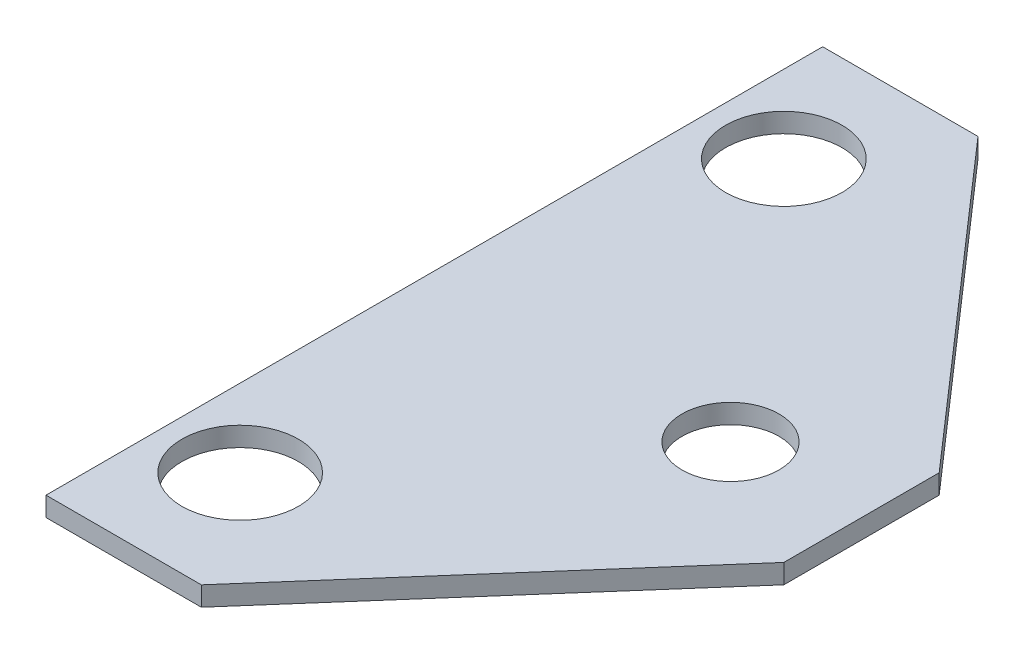
ISO-10303-21;
HEADER;
FILE_DESCRIPTION(('STEP AP214'),'2;1');
FILE_NAME('part.step','',(''),(''),'','','');
FILE_SCHEMA(('AUTOMOTIVE_DESIGN { 1 0 10303 214 1 1 1 1 }'));
ENDSEC;
DATA;
#1=APPLICATION_CONTEXT('core data for automotive mechanical design processes');
#2=APPLICATION_PROTOCOL_DEFINITION('international standard','automotive_design',2000,#1);
#3=PRODUCT_CONTEXT('',#1,'mechanical');
#4=PRODUCT('Part','Part','',(#3));
#5=PRODUCT_RELATED_PRODUCT_CATEGORY('part','',(#4));
#6=PRODUCT_DEFINITION_FORMATION('','',#4);
#7=PRODUCT_DEFINITION_CONTEXT('part definition',#1,'design');
#8=PRODUCT_DEFINITION('design','',#6,#7);
#9=PRODUCT_DEFINITION_SHAPE('','',#8);
#10=(LENGTH_UNIT() NAMED_UNIT(*) SI_UNIT(.MILLI.,.METRE.));
#11=(NAMED_UNIT(*) PLANE_ANGLE_UNIT() SI_UNIT($,.RADIAN.));
#12=(NAMED_UNIT(*) SI_UNIT($,.STERADIAN.) SOLID_ANGLE_UNIT());
#13=UNCERTAINTY_MEASURE_WITH_UNIT(LENGTH_MEASURE(1.E-05),#10,'distance_accuracy_value','');
#14=(GEOMETRIC_REPRESENTATION_CONTEXT(3) GLOBAL_UNCERTAINTY_ASSIGNED_CONTEXT((#13)) GLOBAL_UNIT_ASSIGNED_CONTEXT((#10,
#11,#12)) REPRESENTATION_CONTEXT('',''));
#15=CARTESIAN_POINT('',(0.,0.,0.));
#16=DIRECTION('',(0.,0.,1.));
#17=DIRECTION('',(1.,0.,0.));
#18=AXIS2_PLACEMENT_3D('',#15,#16,#17);
#19=CARTESIAN_POINT('',(3.40839309029562,0.5,-16.5330736697323));
#20=DIRECTION('',(0.,0.,1.));
#21=DIRECTION('',(1.,0.,0.));
#22=AXIS2_PLACEMENT_3D('',#19,#20,#21);
#23=PLANE('',#22);
#24=DIRECTION('',(-1.,0.,0.));
#25=VECTOR('',#24,1.);
#26=CARTESIAN_POINT('',(3.40839309029562,0.,-16.5330736697323));
#27=LINE('',#26,#25);
#28=CARTESIAN_POINT('',(3.40839309029562,0.,-16.5330736697323));
#29=VERTEX_POINT('',#28);
#30=CARTESIAN_POINT('',(-0.591606909704378,0.,-16.5330736697323));
#31=VERTEX_POINT('',#30);
#32=EDGE_CURVE('E121',#29,#31,#27,.T.);
#33=ORIENTED_EDGE('',*,*,#32,.T.);
#34=DIRECTION('',(0.,-1.,0.));
#35=VECTOR('',#34,1.);
#36=CARTESIAN_POINT('',(-0.591606909704378,0.5,-16.5330736697323));
#37=LINE('',#36,#35);
#38=CARTESIAN_POINT('',(-0.591606909704378,0.5,-16.5330736697323));
#39=VERTEX_POINT('',#38);
#40=EDGE_CURVE('E11',#39,#31,#37,.T.);
#41=ORIENTED_EDGE('',*,*,#40,.F.);
#42=DIRECTION('',(-1.,0.,0.));
#43=VECTOR('',#42,1.);
#44=CARTESIAN_POINT('',(3.40839309029562,0.5,-16.5330736697323));
#45=LINE('',#44,#43);
#46=CARTESIAN_POINT('',(3.40839309029562,0.5,-16.5330736697323));
#47=VERTEX_POINT('',#46);
#48=EDGE_CURVE('E132',#47,#39,#45,.T.);
#49=ORIENTED_EDGE('',*,*,#48,.F.);
#50=DIRECTION('',(0.,-1.,0.));
#51=VECTOR('',#50,1.);
#52=CARTESIAN_POINT('',(3.40839309029562,0.5,-16.5330736697323));
#53=LINE('',#52,#51);
#54=EDGE_CURVE('E117',#47,#29,#53,.T.);
#55=ORIENTED_EDGE('',*,*,#54,.T.);
#56=EDGE_LOOP('',(#33,#41,#49,#55));
#57=FACE_BOUND('',#56,.T.);
#58=ADVANCED_FACE('F35',(#57),#23,.F.);
#59=CARTESIAN_POINT('',(-0.591606909704378,0.5,-16.5330736697323));
#60=DIRECTION('',(1.,0.,0.));
#61=DIRECTION('',(0.,0.,-1.));
#62=AXIS2_PLACEMENT_3D('',#59,#60,#61);
#63=PLANE('',#62);
#64=DIRECTION('',(0.,0.,1.));
#65=VECTOR('',#64,1.);
#66=CARTESIAN_POINT('',(-0.591606909704378,0.,-16.5330736697323));
#67=LINE('',#66,#65);
#68=CARTESIAN_POINT('',(-0.591606909704376,0.,3.46692633026765));
#69=VERTEX_POINT('',#68);
#70=EDGE_CURVE('E124',#31,#69,#67,.T.);
#71=ORIENTED_EDGE('',*,*,#70,.T.);
#72=DIRECTION('',(0.,-1.,0.));
#73=VECTOR('',#72,1.);
#74=CARTESIAN_POINT('',(-0.591606909704376,0.5,3.46692633026765));
#75=LINE('',#74,#73);
#76=CARTESIAN_POINT('',(-0.591606909704376,0.5,3.46692633026765));
#77=VERTEX_POINT('',#76);
#78=EDGE_CURVE('E44',#77,#69,#75,.T.);
#79=ORIENTED_EDGE('',*,*,#78,.F.);
#80=DIRECTION('',(0.,0.,1.));
#81=VECTOR('',#80,1.);
#82=CARTESIAN_POINT('',(-0.591606909704378,0.5,-16.5330736697323));
#83=LINE('',#82,#81);
#84=EDGE_CURVE('E89',#39,#77,#83,.T.);
#85=ORIENTED_EDGE('',*,*,#84,.F.);
#86=ORIENTED_EDGE('',*,*,#40,.T.);
#87=EDGE_LOOP('',(#71,#79,#85,#86));
#88=FACE_BOUND('',#87,.T.);
#89=ADVANCED_FACE('F153',(#88),#63,.F.);
#90=CARTESIAN_POINT('',(-0.591606909704376,0.5,3.46692633026765));
#91=DIRECTION('',(0.,0.,-1.));
#92=DIRECTION('',(-1.,0.,0.));
#93=AXIS2_PLACEMENT_3D('',#90,#91,#92);
#94=PLANE('',#93);
#95=DIRECTION('',(1.,0.,0.));
#96=VECTOR('',#95,1.);
#97=CARTESIAN_POINT('',(-0.591606909704376,0.,3.46692633026765));
#98=LINE('',#97,#96);
#99=CARTESIAN_POINT('',(3.40839309029562,0.,3.46692633026765));
#100=VERTEX_POINT('',#99);
#101=EDGE_CURVE('E127',#69,#100,#98,.T.);
#102=ORIENTED_EDGE('',*,*,#101,.T.);
#103=DIRECTION('',(0.,-1.,0.));
#104=VECTOR('',#103,1.);
#105=CARTESIAN_POINT('',(3.40839309029562,0.5,3.46692633026765));
#106=LINE('',#105,#104);
#107=CARTESIAN_POINT('',(3.40839309029562,0.5,3.46692633026765));
#108=VERTEX_POINT('',#107);
#109=EDGE_CURVE('E112',#108,#100,#106,.T.);
#110=ORIENTED_EDGE('',*,*,#109,.F.);
#111=DIRECTION('',(1.,0.,0.));
#112=VECTOR('',#111,1.);
#113=CARTESIAN_POINT('',(-0.591606909704376,0.5,3.46692633026765));
#114=LINE('',#113,#112);
#115=EDGE_CURVE('E102',#77,#108,#114,.T.);
#116=ORIENTED_EDGE('',*,*,#115,.F.);
#117=ORIENTED_EDGE('',*,*,#78,.T.);
#118=EDGE_LOOP('',(#102,#110,#116,#117));
#119=FACE_BOUND('',#118,.T.);
#120=ADVANCED_FACE('F156',(#119),#94,.F.);
#121=CARTESIAN_POINT('',(3.40839309029562,0.5,3.46692633026765));
#122=DIRECTION('',(-0.752576694706878,0.,-0.658504607868518));
#123=DIRECTION('',(-0.658504607868518,0.,0.752576694706878));
#124=AXIS2_PLACEMENT_3D('',#121,#122,#123);
#125=PLANE('',#124);
#126=DIRECTION('',(0.658504607868518,0.,-0.752576694706878));
#127=VECTOR('',#126,1.);
#128=CARTESIAN_POINT('',(3.40839309029562,0.,3.46692633026765));
#129=LINE('',#128,#127);
#130=CARTESIAN_POINT('',(10.4083930902956,0.,-4.53307366973235));
#131=VERTEX_POINT('',#130);
#132=EDGE_CURVE('E111',#100,#131,#129,.T.);
#133=ORIENTED_EDGE('',*,*,#132,.T.);
#134=DIRECTION('',(0.,-1.,0.));
#135=VECTOR('',#134,1.);
#136=CARTESIAN_POINT('',(10.4083930902956,0.5,-4.53307366973235));
#137=LINE('',#136,#135);
#138=CARTESIAN_POINT('',(10.4083930902956,0.5,-4.53307366973235));
#139=VERTEX_POINT('',#138);
#140=EDGE_CURVE('E108',#139,#131,#137,.T.);
#141=ORIENTED_EDGE('',*,*,#140,.F.);
#142=DIRECTION('',(0.658504607868518,0.,-0.752576694706878));
#143=VECTOR('',#142,1.);
#144=CARTESIAN_POINT('',(3.40839309029562,0.5,3.46692633026765));
#145=LINE('',#144,#143);
#146=EDGE_CURVE('E96',#108,#139,#145,.T.);
#147=ORIENTED_EDGE('',*,*,#146,.F.);
#148=ORIENTED_EDGE('',*,*,#109,.T.);
#149=EDGE_LOOP('',(#133,#141,#147,#148));
#150=FACE_BOUND('',#149,.T.);
#151=ADVANCED_FACE('F109',(#150),#125,.F.);
#152=CARTESIAN_POINT('',(10.4083930902956,0.5,-6.53307366973235));
#153=DIRECTION('',(-1.,0.,0.));
#154=DIRECTION('',(0.,0.,1.));
#155=AXIS2_PLACEMENT_3D('',#152,#153,#154);
#156=PLANE('',#155);
#157=DIRECTION('',(0.,0.,-1.));
#158=VECTOR('',#157,1.);
#159=CARTESIAN_POINT('',(10.4083930902956,0.,-6.53307366973235));
#160=LINE('',#159,#158);
#161=CARTESIAN_POINT('',(10.4083930902956,0.,-8.53307366973235));
#162=VERTEX_POINT('',#161);
#163=EDGE_CURVE('E75',#131,#162,#160,.T.);
#164=ORIENTED_EDGE('',*,*,#163,.T.);
#165=DIRECTION('',(0.,-1.,0.));
#166=VECTOR('',#165,1.);
#167=CARTESIAN_POINT('',(10.4083930902956,0.5,-8.53307366973235));
#168=LINE('',#167,#166);
#169=CARTESIAN_POINT('',(10.4083930902956,0.5,-8.53307366973235));
#170=VERTEX_POINT('',#169);
#171=EDGE_CURVE('E113',#170,#162,#168,.T.);
#172=ORIENTED_EDGE('',*,*,#171,.F.);
#173=DIRECTION('',(0.,0.,-1.));
#174=VECTOR('',#173,1.);
#175=CARTESIAN_POINT('',(10.4083930902956,0.5,-6.53307366973235));
#176=LINE('',#175,#174);
#177=EDGE_CURVE('E100',#139,#170,#176,.T.);
#178=ORIENTED_EDGE('',*,*,#177,.F.);
#179=ORIENTED_EDGE('',*,*,#140,.T.);
#180=EDGE_LOOP('',(#164,#172,#178,#179));
#181=FACE_BOUND('',#180,.T.);
#182=ADVANCED_FACE('F115',(#181),#156,.F.);
#183=CARTESIAN_POINT('',(3.40839309029562,0.5,-16.5330736697323));
#184=DIRECTION('',(-0.752576694706878,0.,0.658504607868518));
#185=DIRECTION('',(0.658504607868518,0.,0.752576694706878));
#186=AXIS2_PLACEMENT_3D('',#183,#184,#185);
#187=PLANE('',#186);
#188=DIRECTION('',(-0.658504607868518,0.,-0.752576694706878));
#189=VECTOR('',#188,1.);
#190=CARTESIAN_POINT('',(3.40839309029562,0.,-16.5330736697323));
#191=LINE('',#190,#189);
#192=EDGE_CURVE('E81',#162,#29,#191,.T.);
#193=ORIENTED_EDGE('',*,*,#192,.T.);
#194=ORIENTED_EDGE('',*,*,#54,.F.);
#195=DIRECTION('',(-0.658504607868518,0.,-0.752576694706878));
#196=VECTOR('',#195,1.);
#197=CARTESIAN_POINT('',(3.40839309029562,0.5,-16.5330736697323));
#198=LINE('',#197,#196);
#199=EDGE_CURVE('E53',#170,#47,#198,.T.);
#200=ORIENTED_EDGE('',*,*,#199,.F.);
#201=ORIENTED_EDGE('',*,*,#171,.T.);
#202=EDGE_LOOP('',(#193,#194,#200,#201));
#203=FACE_BOUND('',#202,.T.);
#204=ADVANCED_FACE('F161',(#203),#187,.F.);
#205=CARTESIAN_POINT('',(0.,0.5,0.));
#206=DIRECTION('',(0.,1.,0.));
#207=DIRECTION('',(0.,0.,1.));
#208=AXIS2_PLACEMENT_3D('',#205,#206,#207);
#209=PLANE('',#208);
#210=CARTESIAN_POINT('',(7.03494621630394,0.5,-6.53307366973244));
#211=DIRECTION('',(0.,1.,0.));
#212=DIRECTION('',(0.,0.,1.));
#213=AXIS2_PLACEMENT_3D('',#210,#211,#212);
#214=CIRCLE('',#213,1.24999999999999);
#215=CARTESIAN_POINT('',(7.03494621630394,0.5,-5.28307366973246));
#216=VERTEX_POINT('',#215);
#217=EDGE_CURVE('E247',#216,#216,#214,.T.);
#218=ORIENTED_EDGE('',*,*,#217,.F.);
#219=EDGE_LOOP('',(#218));
#220=FACE_BOUND('',#219,.T.);
#221=CARTESIAN_POINT('',(1.40839309029562,0.5,-13.5330736697323));
#222=DIRECTION('',(0.,1.,0.));
#223=DIRECTION('',(0.,0.,1.));
#224=AXIS2_PLACEMENT_3D('',#221,#222,#223);
#225=CIRCLE('',#224,1.5);
#226=CARTESIAN_POINT('',(1.40839309029562,0.5,-12.0330736697324));
#227=VERTEX_POINT('',#226);
#228=EDGE_CURVE('E146',#227,#227,#225,.T.);
#229=ORIENTED_EDGE('',*,*,#228,.F.);
#230=EDGE_LOOP('',(#229));
#231=FACE_BOUND('',#230,.T.);
#232=CARTESIAN_POINT('',(1.40839309029562,0.5,0.466926330267652));
#233=DIRECTION('',(0.,1.,0.));
#234=DIRECTION('',(0.,0.,1.));
#235=AXIS2_PLACEMENT_3D('',#232,#233,#234);
#236=CIRCLE('',#235,1.5);
#237=CARTESIAN_POINT('',(1.40839309029562,0.5,1.96692633026765));
#238=VERTEX_POINT('',#237);
#239=EDGE_CURVE('E138',#238,#238,#236,.T.);
#240=ORIENTED_EDGE('',*,*,#239,.F.);
#241=EDGE_LOOP('',(#240));
#242=FACE_BOUND('',#241,.T.);
#243=ORIENTED_EDGE('',*,*,#48,.T.);
#244=ORIENTED_EDGE('',*,*,#84,.T.);
#245=ORIENTED_EDGE('',*,*,#115,.T.);
#246=ORIENTED_EDGE('',*,*,#146,.T.);
#247=ORIENTED_EDGE('',*,*,#177,.T.);
#248=ORIENTED_EDGE('',*,*,#199,.T.);
#249=EDGE_LOOP('',(#243,#244,#245,#246,#247,#248));
#250=FACE_BOUND('',#249,.T.);
#251=ADVANCED_FACE('F98',(#220,#231,#242,#250),#209,.T.);
#252=CARTESIAN_POINT('',(0.,0.,0.));
#253=DIRECTION('',(0.,1.,0.));
#254=DIRECTION('',(0.,0.,1.));
#255=AXIS2_PLACEMENT_3D('',#252,#253,#254);
#256=PLANE('',#255);
#257=CARTESIAN_POINT('',(7.03494621630394,0.,-6.53307366973244));
#258=DIRECTION('',(0.,-1.,0.));
#259=DIRECTION('',(0.,0.,-1.));
#260=AXIS2_PLACEMENT_3D('',#257,#258,#259);
#261=CIRCLE('',#260,1.24999999999999);
#262=CARTESIAN_POINT('',(7.03494621630394,0.,-7.78307366973243));
#263=VERTEX_POINT('',#262);
#264=EDGE_CURVE('E250',#263,#263,#261,.T.);
#265=ORIENTED_EDGE('',*,*,#264,.F.);
#266=EDGE_LOOP('',(#265));
#267=FACE_BOUND('',#266,.T.);
#268=CARTESIAN_POINT('',(1.40839309029562,0.,-13.5330736697323));
#269=DIRECTION('',(0.,1.,0.));
#270=DIRECTION('',(0.,0.,1.));
#271=AXIS2_PLACEMENT_3D('',#268,#269,#270);
#272=CIRCLE('',#271,1.5);
#273=CARTESIAN_POINT('',(1.40839309029562,0.,-12.0330736697324));
#274=VERTEX_POINT('',#273);
#275=EDGE_CURVE('E38',#274,#274,#272,.T.);
#276=ORIENTED_EDGE('',*,*,#275,.T.);
#277=EDGE_LOOP('',(#276));
#278=FACE_BOUND('',#277,.T.);
#279=CARTESIAN_POINT('',(1.40839309029562,0.,0.466926330267652));
#280=DIRECTION('',(0.,1.,0.));
#281=DIRECTION('',(0.,0.,1.));
#282=AXIS2_PLACEMENT_3D('',#279,#280,#281);
#283=CIRCLE('',#282,1.5);
#284=CARTESIAN_POINT('',(1.40839309029562,0.,1.96692633026765));
#285=VERTEX_POINT('',#284);
#286=EDGE_CURVE('E125',#285,#285,#283,.T.);
#287=ORIENTED_EDGE('',*,*,#286,.T.);
#288=EDGE_LOOP('',(#287));
#289=FACE_BOUND('',#288,.T.);
#290=ORIENTED_EDGE('',*,*,#32,.F.);
#291=ORIENTED_EDGE('',*,*,#192,.F.);
#292=ORIENTED_EDGE('',*,*,#163,.F.);
#293=ORIENTED_EDGE('',*,*,#132,.F.);
#294=ORIENTED_EDGE('',*,*,#101,.F.);
#295=ORIENTED_EDGE('',*,*,#70,.F.);
#296=EDGE_LOOP('',(#290,#291,#292,#293,#294,#295));
#297=FACE_BOUND('',#296,.T.);
#298=ADVANCED_FACE('F159',(#267,#278,#289,#297),#256,.F.);
#299=CARTESIAN_POINT('',(1.40839309029562,0.5,0.466926330267652));
#300=DIRECTION('',(0.,1.,0.));
#301=DIRECTION('',(0.,0.,1.));
#302=AXIS2_PLACEMENT_3D('',#299,#300,#301);
#303=CYLINDRICAL_SURFACE('',#302,1.5);
#304=ORIENTED_EDGE('',*,*,#239,.T.);
#305=EDGE_LOOP('',(#304));
#306=FACE_BOUND('',#305,.T.);
#307=ORIENTED_EDGE('',*,*,#286,.F.);
#308=EDGE_LOOP('',(#307));
#309=FACE_BOUND('',#308,.T.);
#310=ADVANCED_FACE('F201',(#306,#309),#303,.F.);
#311=CARTESIAN_POINT('',(1.40839309029562,0.5,-13.5330736697323));
#312=DIRECTION('',(0.,1.,0.));
#313=DIRECTION('',(0.,0.,1.));
#314=AXIS2_PLACEMENT_3D('',#311,#312,#313);
#315=CYLINDRICAL_SURFACE('',#314,1.5);
#316=ORIENTED_EDGE('',*,*,#228,.T.);
#317=EDGE_LOOP('',(#316));
#318=FACE_BOUND('',#317,.T.);
#319=ORIENTED_EDGE('',*,*,#275,.F.);
#320=EDGE_LOOP('',(#319));
#321=FACE_BOUND('',#320,.T.);
#322=ADVANCED_FACE('F206',(#318,#321),#315,.F.);
#323=CARTESIAN_POINT('',(7.03494621630394,0.,-6.53307366973244));
#324=DIRECTION('',(0.,-1.,0.));
#325=DIRECTION('',(0.,0.,-1.));
#326=AXIS2_PLACEMENT_3D('',#323,#324,#325);
#327=CYLINDRICAL_SURFACE('',#326,1.24999999999999);
#328=ORIENTED_EDGE('',*,*,#217,.T.);
#329=EDGE_LOOP('',(#328));
#330=FACE_BOUND('',#329,.T.);
#331=ORIENTED_EDGE('',*,*,#264,.T.);
#332=EDGE_LOOP('',(#331));
#333=FACE_BOUND('',#332,.T.);
#334=ADVANCED_FACE('F217',(#330,#333),#327,.F.);
#335=CLOSED_SHELL('',(#58,#89,#120,#151,#182,#204,#251,#298,#310,#322,#334));
#336=MANIFOLD_SOLID_BREP('B2',#335);
#337=ADVANCED_BREP_SHAPE_REPRESENTATION('',(#18,#336),#14);
#338=SHAPE_DEFINITION_REPRESENTATION(#9,#337);
ENDSEC;
END-ISO-10303-21;
